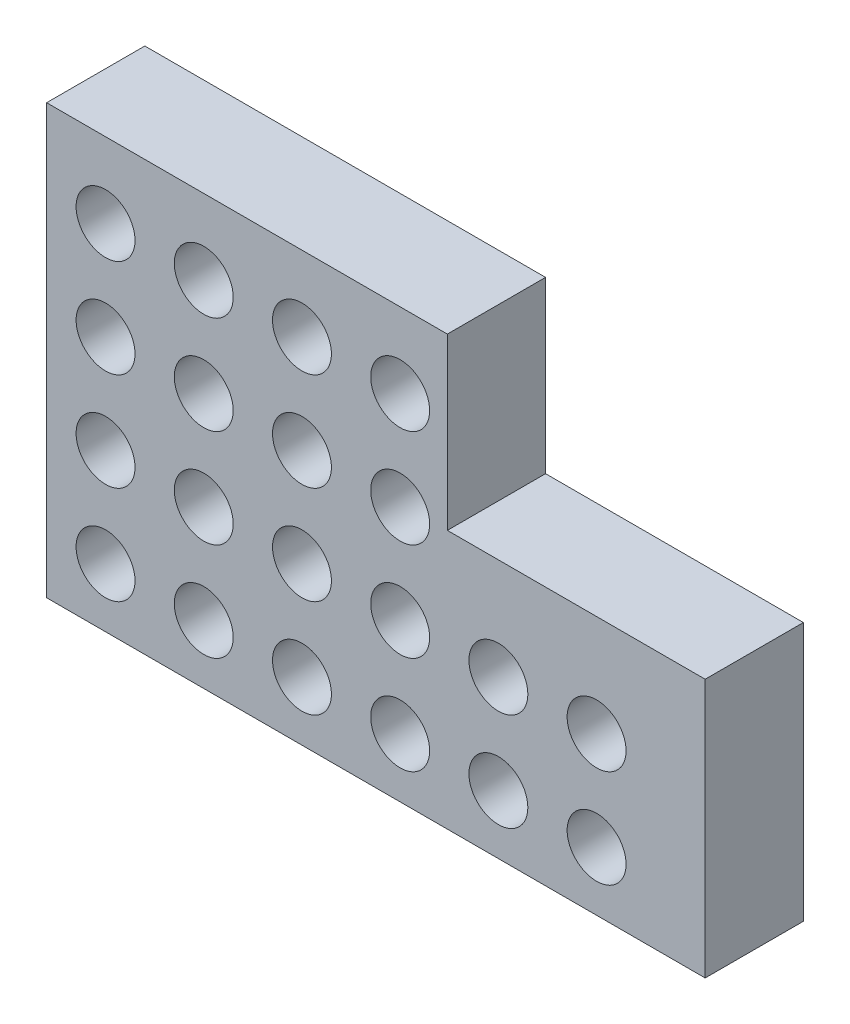
ISO-10303-21;
HEADER;
FILE_DESCRIPTION(('STEP AP214'),'2;1');
FILE_NAME('part.step','',(''),(''),'','','');
FILE_SCHEMA(('AUTOMOTIVE_DESIGN { 1 0 10303 214 1 1 1 1 }'));
ENDSEC;
DATA;
#1=APPLICATION_CONTEXT('core data for automotive mechanical design processes');
#2=APPLICATION_PROTOCOL_DEFINITION('international standard','automotive_design',2000,#1);
#3=PRODUCT_CONTEXT('',#1,'mechanical');
#4=PRODUCT('Part','Part','',(#3));
#5=PRODUCT_RELATED_PRODUCT_CATEGORY('part','',(#4));
#6=PRODUCT_DEFINITION_FORMATION('','',#4);
#7=PRODUCT_DEFINITION_CONTEXT('part definition',#1,'design');
#8=PRODUCT_DEFINITION('design','',#6,#7);
#9=PRODUCT_DEFINITION_SHAPE('','',#8);
#10=(LENGTH_UNIT() NAMED_UNIT(*) SI_UNIT(.MILLI.,.METRE.));
#11=(NAMED_UNIT(*) PLANE_ANGLE_UNIT() SI_UNIT($,.RADIAN.));
#12=(NAMED_UNIT(*) SI_UNIT($,.STERADIAN.) SOLID_ANGLE_UNIT());
#13=UNCERTAINTY_MEASURE_WITH_UNIT(LENGTH_MEASURE(1.E-05),#10,'distance_accuracy_value','');
#14=(GEOMETRIC_REPRESENTATION_CONTEXT(3) GLOBAL_UNCERTAINTY_ASSIGNED_CONTEXT((#13)) GLOBAL_UNIT_ASSIGNED_CONTEXT((#10,
#11,#12)) REPRESENTATION_CONTEXT('',''));
#15=CARTESIAN_POINT('',(0.,0.,0.));
#16=DIRECTION('',(0.,0.,1.));
#17=DIRECTION('',(1.,0.,0.));
#18=AXIS2_PLACEMENT_3D('',#15,#16,#17);
#19=CARTESIAN_POINT('',(67.0563920353644,0.,10.));
#20=DIRECTION('',(0.,1.,0.));
#21=DIRECTION('',(0.,0.,1.));
#22=AXIS2_PLACEMENT_3D('',#19,#20,#21);
#23=PLANE('',#22);
#24=DIRECTION('',(1.,0.,0.));
#25=VECTOR('',#24,1.);
#26=CARTESIAN_POINT('',(67.0563920353644,0.,0.));
#27=LINE('',#26,#25);
#28=CARTESIAN_POINT('',(0.,0.,0.));
#29=VERTEX_POINT('',#28);
#30=CARTESIAN_POINT('',(67.0563920353644,0.,0.));
#31=VERTEX_POINT('',#30);
#32=EDGE_CURVE('E117',#29,#31,#27,.T.);
#33=ORIENTED_EDGE('',*,*,#32,.T.);
#34=DIRECTION('',(0.,0.,-1.));
#35=VECTOR('',#34,1.);
#36=CARTESIAN_POINT('',(67.0563920353644,0.,10.));
#37=LINE('',#36,#35);
#38=CARTESIAN_POINT('',(67.0563920353644,0.,10.));
#39=VERTEX_POINT('',#38);
#40=EDGE_CURVE('E11',#39,#31,#37,.T.);
#41=ORIENTED_EDGE('',*,*,#40,.F.);
#42=DIRECTION('',(1.,0.,0.));
#43=VECTOR('',#42,1.);
#44=CARTESIAN_POINT('',(67.0563920353644,0.,10.));
#45=LINE('',#44,#43);
#46=CARTESIAN_POINT('',(0.,0.,10.));
#47=VERTEX_POINT('',#46);
#48=EDGE_CURVE('E128',#47,#39,#45,.T.);
#49=ORIENTED_EDGE('',*,*,#48,.F.);
#50=DIRECTION('',(0.,0.,-1.));
#51=VECTOR('',#50,1.);
#52=CARTESIAN_POINT('',(0.,0.,10.));
#53=LINE('',#52,#51);
#54=EDGE_CURVE('E113',#47,#29,#53,.T.);
#55=ORIENTED_EDGE('',*,*,#54,.T.);
#56=EDGE_LOOP('',(#33,#41,#49,#55));
#57=FACE_BOUND('',#56,.T.);
#58=ADVANCED_FACE('F33',(#57),#23,.F.);
#59=CARTESIAN_POINT('',(67.0563920353644,26.346979565668,10.));
#60=DIRECTION('',(-1.,0.,0.));
#61=DIRECTION('',(0.,0.,1.));
#62=AXIS2_PLACEMENT_3D('',#59,#60,#61);
#63=PLANE('',#62);
#64=DIRECTION('',(0.,1.,0.));
#65=VECTOR('',#64,1.);
#66=CARTESIAN_POINT('',(67.0563920353644,26.346979565668,0.));
#67=LINE('',#66,#65);
#68=CARTESIAN_POINT('',(67.0563920353644,26.346979565668,0.));
#69=VERTEX_POINT('',#68);
#70=EDGE_CURVE('E120',#31,#69,#67,.T.);
#71=ORIENTED_EDGE('',*,*,#70,.T.);
#72=DIRECTION('',(0.,0.,-1.));
#73=VECTOR('',#72,1.);
#74=CARTESIAN_POINT('',(67.0563920353644,26.346979565668,10.));
#75=LINE('',#74,#73);
#76=CARTESIAN_POINT('',(67.0563920353644,26.346979565668,10.));
#77=VERTEX_POINT('',#76);
#78=EDGE_CURVE('E41',#77,#69,#75,.T.);
#79=ORIENTED_EDGE('',*,*,#78,.F.);
#80=DIRECTION('',(0.,1.,0.));
#81=VECTOR('',#80,1.);
#82=CARTESIAN_POINT('',(67.0563920353644,4.28019523629986,10.));
#83=LINE('',#82,#81);
#84=EDGE_CURVE('E86',#39,#77,#83,.T.);
#85=ORIENTED_EDGE('',*,*,#84,.F.);
#86=ORIENTED_EDGE('',*,*,#40,.T.);
#87=EDGE_LOOP('',(#71,#79,#85,#86));
#88=FACE_BOUND('',#87,.T.);
#89=ADVANCED_FACE('F153',(#88),#63,.F.);
#90=CARTESIAN_POINT('',(40.8045279193919,26.346979565668,10.));
#91=DIRECTION('',(0.,-1.,0.));
#92=DIRECTION('',(0.,0.,-1.));
#93=AXIS2_PLACEMENT_3D('',#90,#91,#92);
#94=PLANE('',#93);
#95=DIRECTION('',(-1.,0.,0.));
#96=VECTOR('',#95,1.);
#97=CARTESIAN_POINT('',(40.8045279193919,26.346979565668,0.));
#98=LINE('',#97,#96);
#99=CARTESIAN_POINT('',(40.8045279193919,26.346979565668,0.));
#100=VERTEX_POINT('',#99);
#101=EDGE_CURVE('E123',#69,#100,#98,.T.);
#102=ORIENTED_EDGE('',*,*,#101,.T.);
#103=DIRECTION('',(0.,0.,-1.));
#104=VECTOR('',#103,1.);
#105=CARTESIAN_POINT('',(40.8045279193919,26.346979565668,10.));
#106=LINE('',#105,#104);
#107=CARTESIAN_POINT('',(40.8045279193919,26.346979565668,10.));
#108=VERTEX_POINT('',#107);
#109=EDGE_CURVE('E108',#108,#100,#106,.T.);
#110=ORIENTED_EDGE('',*,*,#109,.F.);
#111=DIRECTION('',(-1.,0.,0.));
#112=VECTOR('',#111,1.);
#113=CARTESIAN_POINT('',(40.8045279193919,26.346979565668,10.));
#114=LINE('',#113,#112);
#115=EDGE_CURVE('E99',#77,#108,#114,.T.);
#116=ORIENTED_EDGE('',*,*,#115,.F.);
#117=ORIENTED_EDGE('',*,*,#78,.T.);
#118=EDGE_LOOP('',(#102,#110,#116,#117));
#119=FACE_BOUND('',#118,.T.);
#120=ADVANCED_FACE('F134',(#119),#94,.F.);
#121=CARTESIAN_POINT('',(40.8045279193919,43.6579914102585,10.));
#122=DIRECTION('',(-1.,0.,0.));
#123=DIRECTION('',(0.,0.,1.));
#124=AXIS2_PLACEMENT_3D('',#121,#122,#123);
#125=PLANE('',#124);
#126=DIRECTION('',(0.,1.,0.));
#127=VECTOR('',#126,1.);
#128=CARTESIAN_POINT('',(40.8045279193919,43.6579914102585,0.));
#129=LINE('',#128,#127);
#130=CARTESIAN_POINT('',(40.8045279193919,43.6579914102585,0.));
#131=VERTEX_POINT('',#130);
#132=EDGE_CURVE('E107',#100,#131,#129,.T.);
#133=ORIENTED_EDGE('',*,*,#132,.T.);
#134=DIRECTION('',(0.,0.,-1.));
#135=VECTOR('',#134,1.);
#136=CARTESIAN_POINT('',(40.8045279193919,43.6579914102585,10.));
#137=LINE('',#136,#135);
#138=CARTESIAN_POINT('',(40.8045279193919,43.6579914102585,10.));
#139=VERTEX_POINT('',#138);
#140=EDGE_CURVE('E104',#139,#131,#137,.T.);
#141=ORIENTED_EDGE('',*,*,#140,.F.);
#142=DIRECTION('',(0.,1.,0.));
#143=VECTOR('',#142,1.);
#144=CARTESIAN_POINT('',(40.8045279193919,43.6579914102585,10.));
#145=LINE('',#144,#143);
#146=EDGE_CURVE('E93',#108,#139,#145,.T.);
#147=ORIENTED_EDGE('',*,*,#146,.F.);
#148=ORIENTED_EDGE('',*,*,#109,.T.);
#149=EDGE_LOOP('',(#133,#141,#147,#148));
#150=FACE_BOUND('',#149,.T.);
#151=ADVANCED_FACE('F105',(#150),#125,.F.);
#152=CARTESIAN_POINT('',(0.,43.6579914102585,10.));
#153=DIRECTION('',(0.,-1.,0.));
#154=DIRECTION('',(0.,0.,-1.));
#155=AXIS2_PLACEMENT_3D('',#152,#153,#154);
#156=PLANE('',#155);
#157=DIRECTION('',(-1.,0.,0.));
#158=VECTOR('',#157,1.);
#159=CARTESIAN_POINT('',(0.,43.6579914102585,0.));
#160=LINE('',#159,#158);
#161=CARTESIAN_POINT('',(0.,43.6579914102585,0.));
#162=VERTEX_POINT('',#161);
#163=EDGE_CURVE('E72',#131,#162,#160,.T.);
#164=ORIENTED_EDGE('',*,*,#163,.T.);
#165=DIRECTION('',(0.,0.,-1.));
#166=VECTOR('',#165,1.);
#167=CARTESIAN_POINT('',(0.,43.6579914102585,10.));
#168=LINE('',#167,#166);
#169=CARTESIAN_POINT('',(0.,43.6579914102585,10.));
#170=VERTEX_POINT('',#169);
#171=EDGE_CURVE('E109',#170,#162,#168,.T.);
#172=ORIENTED_EDGE('',*,*,#171,.F.);
#173=DIRECTION('',(-1.,0.,0.));
#174=VECTOR('',#173,1.);
#175=CARTESIAN_POINT('',(0.,43.6579914102585,10.));
#176=LINE('',#175,#174);
#177=EDGE_CURVE('E97',#139,#170,#176,.T.);
#178=ORIENTED_EDGE('',*,*,#177,.F.);
#179=ORIENTED_EDGE('',*,*,#140,.T.);
#180=EDGE_LOOP('',(#164,#172,#178,#179));
#181=FACE_BOUND('',#180,.T.);
#182=ADVANCED_FACE('F111',(#181),#156,.F.);
#183=CARTESIAN_POINT('',(0.,0.,10.));
#184=DIRECTION('',(1.,0.,0.));
#185=DIRECTION('',(0.,0.,-1.));
#186=AXIS2_PLACEMENT_3D('',#183,#184,#185);
#187=PLANE('',#186);
#188=DIRECTION('',(0.,-1.,0.));
#189=VECTOR('',#188,1.);
#190=CARTESIAN_POINT('',(0.,0.,0.));
#191=LINE('',#190,#189);
#192=EDGE_CURVE('E78',#162,#29,#191,.T.);
#193=ORIENTED_EDGE('',*,*,#192,.T.);
#194=ORIENTED_EDGE('',*,*,#54,.F.);
#195=DIRECTION('',(0.,-1.,0.));
#196=VECTOR('',#195,1.);
#197=CARTESIAN_POINT('',(0.,0.,10.));
#198=LINE('',#197,#196);
#199=EDGE_CURVE('E49',#170,#47,#198,.T.);
#200=ORIENTED_EDGE('',*,*,#199,.F.);
#201=ORIENTED_EDGE('',*,*,#171,.T.);
#202=EDGE_LOOP('',(#193,#194,#200,#201));
#203=FACE_BOUND('',#202,.T.);
#204=ADVANCED_FACE('F141',(#203),#187,.F.);
#205=CARTESIAN_POINT('',(0.,0.,10.));
#206=DIRECTION('',(0.,0.,-1.));
#207=DIRECTION('',(-1.,0.,0.));
#208=AXIS2_PLACEMENT_3D('',#205,#206,#207);
#209=PLANE('',#208);
#210=CARTESIAN_POINT('',(36.,26.,10.));
#211=DIRECTION('',(0.,0.,1.));
#212=DIRECTION('',(1.,0.,0.));
#213=AXIS2_PLACEMENT_3D('',#210,#211,#212);
#214=CIRCLE('',#213,3.);
#215=CARTESIAN_POINT('',(39.,26.,10.));
#216=VERTEX_POINT('',#215);
#217=EDGE_CURVE('E396',#216,#216,#214,.T.);
#218=ORIENTED_EDGE('',*,*,#217,.F.);
#219=EDGE_LOOP('',(#218));
#220=FACE_BOUND('',#219,.T.);
#221=CARTESIAN_POINT('',(36.,16.,10.));
#222=DIRECTION('',(0.,0.,1.));
#223=DIRECTION('',(1.,0.,0.));
#224=AXIS2_PLACEMENT_3D('',#221,#222,#223);
#225=CIRCLE('',#224,3.);
#226=CARTESIAN_POINT('',(39.,16.,10.));
#227=VERTEX_POINT('',#226);
#228=EDGE_CURVE('E400',#227,#227,#225,.T.);
#229=ORIENTED_EDGE('',*,*,#228,.F.);
#230=EDGE_LOOP('',(#229));
#231=FACE_BOUND('',#230,.T.);
#232=CARTESIAN_POINT('',(36.,6.,10.));
#233=DIRECTION('',(0.,0.,1.));
#234=DIRECTION('',(1.,0.,0.));
#235=AXIS2_PLACEMENT_3D('',#232,#233,#234);
#236=CIRCLE('',#235,3.);
#237=CARTESIAN_POINT('',(39.,6.,10.));
#238=VERTEX_POINT('',#237);
#239=EDGE_CURVE('E417',#238,#238,#236,.T.);
#240=ORIENTED_EDGE('',*,*,#239,.F.);
#241=EDGE_LOOP('',(#240));
#242=FACE_BOUND('',#241,.T.);
#243=CARTESIAN_POINT('',(26.,36.,10.));
#244=DIRECTION('',(0.,0.,1.));
#245=DIRECTION('',(1.,0.,0.));
#246=AXIS2_PLACEMENT_3D('',#243,#244,#245);
#247=CIRCLE('',#246,3.);
#248=CARTESIAN_POINT('',(29.,36.,10.));
#249=VERTEX_POINT('',#248);
#250=EDGE_CURVE('E409',#249,#249,#247,.T.);
#251=ORIENTED_EDGE('',*,*,#250,.F.);
#252=EDGE_LOOP('',(#251));
#253=FACE_BOUND('',#252,.T.);
#254=CARTESIAN_POINT('',(56.,16.,10.));
#255=DIRECTION('',(0.,0.,1.));
#256=DIRECTION('',(1.,0.,0.));
#257=AXIS2_PLACEMENT_3D('',#254,#255,#256);
#258=CIRCLE('',#257,3.);
#259=CARTESIAN_POINT('',(59.,16.,10.));
#260=VERTEX_POINT('',#259);
#261=EDGE_CURVE('E590',#260,#260,#258,.T.);
#262=ORIENTED_EDGE('',*,*,#261,.F.);
#263=EDGE_LOOP('',(#262));
#264=FACE_BOUND('',#263,.T.);
#265=CARTESIAN_POINT('',(56.,6.,10.));
#266=DIRECTION('',(0.,0.,1.));
#267=DIRECTION('',(1.,0.,0.));
#268=AXIS2_PLACEMENT_3D('',#265,#266,#267);
#269=CIRCLE('',#268,3.);
#270=CARTESIAN_POINT('',(59.,6.,10.));
#271=VERTEX_POINT('',#270);
#272=EDGE_CURVE('E586',#271,#271,#269,.T.);
#273=ORIENTED_EDGE('',*,*,#272,.F.);
#274=EDGE_LOOP('',(#273));
#275=FACE_BOUND('',#274,.T.);
#276=CARTESIAN_POINT('',(46.,16.,10.));
#277=DIRECTION('',(0.,0.,1.));
#278=DIRECTION('',(1.,0.,0.));
#279=AXIS2_PLACEMENT_3D('',#276,#277,#278);
#280=CIRCLE('',#279,3.);
#281=CARTESIAN_POINT('',(49.,16.,10.));
#282=VERTEX_POINT('',#281);
#283=EDGE_CURVE('E581',#282,#282,#280,.T.);
#284=ORIENTED_EDGE('',*,*,#283,.F.);
#285=EDGE_LOOP('',(#284));
#286=FACE_BOUND('',#285,.T.);
#287=CARTESIAN_POINT('',(46.,6.,10.));
#288=DIRECTION('',(0.,0.,1.));
#289=DIRECTION('',(1.,0.,0.));
#290=AXIS2_PLACEMENT_3D('',#287,#288,#289);
#291=CIRCLE('',#290,3.);
#292=CARTESIAN_POINT('',(49.,6.,10.));
#293=VERTEX_POINT('',#292);
#294=EDGE_CURVE('E573',#293,#293,#291,.T.);
#295=ORIENTED_EDGE('',*,*,#294,.F.);
#296=EDGE_LOOP('',(#295));
#297=FACE_BOUND('',#296,.T.);
#298=CARTESIAN_POINT('',(36.,36.,10.));
#299=DIRECTION('',(0.,0.,1.));
#300=DIRECTION('',(1.,0.,0.));
#301=AXIS2_PLACEMENT_3D('',#298,#299,#300);
#302=CIRCLE('',#301,3.);
#303=CARTESIAN_POINT('',(39.,36.,10.));
#304=VERTEX_POINT('',#303);
#305=EDGE_CURVE('E567',#304,#304,#302,.T.);
#306=ORIENTED_EDGE('',*,*,#305,.F.);
#307=EDGE_LOOP('',(#306));
#308=FACE_BOUND('',#307,.T.);
#309=CARTESIAN_POINT('',(6.,26.,10.));
#310=DIRECTION('',(0.,0.,1.));
#311=DIRECTION('',(1.,0.,0.));
#312=AXIS2_PLACEMENT_3D('',#309,#310,#311);
#313=CIRCLE('',#312,3.);
#314=CARTESIAN_POINT('',(9.,26.,10.));
#315=VERTEX_POINT('',#314);
#316=EDGE_CURVE('E452',#315,#315,#313,.T.);
#317=ORIENTED_EDGE('',*,*,#316,.F.);
#318=EDGE_LOOP('',(#317));
#319=FACE_BOUND('',#318,.T.);
#320=CARTESIAN_POINT('',(6.,36.,10.));
#321=DIRECTION('',(0.,0.,1.));
#322=DIRECTION('',(1.,0.,0.));
#323=AXIS2_PLACEMENT_3D('',#320,#321,#322);
#324=CIRCLE('',#323,3.);
#325=CARTESIAN_POINT('',(9.,36.,10.));
#326=VERTEX_POINT('',#325);
#327=EDGE_CURVE('E460',#326,#326,#324,.T.);
#328=ORIENTED_EDGE('',*,*,#327,.F.);
#329=EDGE_LOOP('',(#328));
#330=FACE_BOUND('',#329,.T.);
#331=CARTESIAN_POINT('',(16.,6.,10.));
#332=DIRECTION('',(0.,0.,1.));
#333=DIRECTION('',(1.,0.,0.));
#334=AXIS2_PLACEMENT_3D('',#331,#332,#333);
#335=CIRCLE('',#334,3.);
#336=CARTESIAN_POINT('',(19.,6.,10.));
#337=VERTEX_POINT('',#336);
#338=EDGE_CURVE('E466',#337,#337,#335,.T.);
#339=ORIENTED_EDGE('',*,*,#338,.F.);
#340=EDGE_LOOP('',(#339));
#341=FACE_BOUND('',#340,.T.);
#342=CARTESIAN_POINT('',(16.,16.,10.));
#343=DIRECTION('',(0.,0.,1.));
#344=DIRECTION('',(1.,0.,0.));
#345=AXIS2_PLACEMENT_3D('',#342,#343,#344);
#346=CIRCLE('',#345,3.);
#347=CARTESIAN_POINT('',(19.,16.,10.));
#348=VERTEX_POINT('',#347);
#349=EDGE_CURVE('E429',#348,#348,#346,.T.);
#350=ORIENTED_EDGE('',*,*,#349,.F.);
#351=EDGE_LOOP('',(#350));
#352=FACE_BOUND('',#351,.T.);
#353=CARTESIAN_POINT('',(16.,26.,10.));
#354=DIRECTION('',(0.,0.,1.));
#355=DIRECTION('',(1.,0.,0.));
#356=AXIS2_PLACEMENT_3D('',#353,#354,#355);
#357=CIRCLE('',#356,3.);
#358=CARTESIAN_POINT('',(19.,26.,10.));
#359=VERTEX_POINT('',#358);
#360=EDGE_CURVE('E422',#359,#359,#357,.T.);
#361=ORIENTED_EDGE('',*,*,#360,.F.);
#362=EDGE_LOOP('',(#361));
#363=FACE_BOUND('',#362,.T.);
#364=CARTESIAN_POINT('',(16.,36.,10.));
#365=DIRECTION('',(0.,0.,1.));
#366=DIRECTION('',(1.,0.,0.));
#367=AXIS2_PLACEMENT_3D('',#364,#365,#366);
#368=CIRCLE('',#367,3.);
#369=CARTESIAN_POINT('',(19.,36.,10.));
#370=VERTEX_POINT('',#369);
#371=EDGE_CURVE('E430',#370,#370,#368,.T.);
#372=ORIENTED_EDGE('',*,*,#371,.F.);
#373=EDGE_LOOP('',(#372));
#374=FACE_BOUND('',#373,.T.);
#375=CARTESIAN_POINT('',(26.,6.,10.));
#376=DIRECTION('',(0.,0.,1.));
#377=DIRECTION('',(1.,0.,0.));
#378=AXIS2_PLACEMENT_3D('',#375,#376,#377);
#379=CIRCLE('',#378,3.);
#380=CARTESIAN_POINT('',(29.,6.,10.));
#381=VERTEX_POINT('',#380);
#382=EDGE_CURVE('E436',#381,#381,#379,.T.);
#383=ORIENTED_EDGE('',*,*,#382,.F.);
#384=EDGE_LOOP('',(#383));
#385=FACE_BOUND('',#384,.T.);
#386=CARTESIAN_POINT('',(26.,16.,10.));
#387=DIRECTION('',(0.,0.,1.));
#388=DIRECTION('',(1.,0.,0.));
#389=AXIS2_PLACEMENT_3D('',#386,#387,#388);
#390=CIRCLE('',#389,3.);
#391=CARTESIAN_POINT('',(29.,16.,10.));
#392=VERTEX_POINT('',#391);
#393=EDGE_CURVE('E442',#392,#392,#390,.T.);
#394=ORIENTED_EDGE('',*,*,#393,.F.);
#395=EDGE_LOOP('',(#394));
#396=FACE_BOUND('',#395,.T.);
#397=CARTESIAN_POINT('',(26.,26.,10.));
#398=DIRECTION('',(0.,0.,1.));
#399=DIRECTION('',(1.,0.,0.));
#400=AXIS2_PLACEMENT_3D('',#397,#398,#399);
#401=CIRCLE('',#400,3.);
#402=CARTESIAN_POINT('',(29.,26.,10.));
#403=VERTEX_POINT('',#402);
#404=EDGE_CURVE('E416',#403,#403,#401,.T.);
#405=ORIENTED_EDGE('',*,*,#404,.F.);
#406=EDGE_LOOP('',(#405));
#407=FACE_BOUND('',#406,.T.);
#408=CARTESIAN_POINT('',(6.,16.,10.));
#409=DIRECTION('',(0.,0.,1.));
#410=DIRECTION('',(1.,0.,0.));
#411=AXIS2_PLACEMENT_3D('',#408,#409,#410);
#412=CIRCLE('',#411,3.);
#413=CARTESIAN_POINT('',(9.,16.,10.));
#414=VERTEX_POINT('',#413);
#415=EDGE_CURVE('E459',#414,#414,#412,.T.);
#416=ORIENTED_EDGE('',*,*,#415,.F.);
#417=EDGE_LOOP('',(#416));
#418=FACE_BOUND('',#417,.T.);
#419=CARTESIAN_POINT('',(6.,6.,10.));
#420=DIRECTION('',(0.,0.,1.));
#421=DIRECTION('',(1.,0.,0.));
#422=AXIS2_PLACEMENT_3D('',#419,#420,#421);
#423=CIRCLE('',#422,3.);
#424=CARTESIAN_POINT('',(9.,6.,10.));
#425=VERTEX_POINT('',#424);
#426=EDGE_CURVE('E481',#425,#425,#423,.T.);
#427=ORIENTED_EDGE('',*,*,#426,.F.);
#428=EDGE_LOOP('',(#427));
#429=FACE_BOUND('',#428,.T.);
#430=ORIENTED_EDGE('',*,*,#48,.T.);
#431=ORIENTED_EDGE('',*,*,#84,.T.);
#432=ORIENTED_EDGE('',*,*,#115,.T.);
#433=ORIENTED_EDGE('',*,*,#146,.T.);
#434=ORIENTED_EDGE('',*,*,#177,.T.);
#435=ORIENTED_EDGE('',*,*,#199,.T.);
#436=EDGE_LOOP('',(#430,#431,#432,#433,#434,#435));
#437=FACE_BOUND('',#436,.T.);
#438=ADVANCED_FACE('F95',(#220,#231,#242,#253,#264,#275,#286,#297,#308,#319,#330,#341,#352,#363,
#374,#385,#396,#407,#418,#429,#437),#209,.F.);
#439=CARTESIAN_POINT('',(0.,0.,0.));
#440=DIRECTION('',(0.,0.,-1.));
#441=DIRECTION('',(-1.,0.,0.));
#442=AXIS2_PLACEMENT_3D('',#439,#440,#441);
#443=PLANE('',#442);
#444=CARTESIAN_POINT('',(36.,26.,0.));
#445=DIRECTION('',(0.,0.,-1.));
#446=DIRECTION('',(-1.,0.,0.));
#447=AXIS2_PLACEMENT_3D('',#444,#445,#446);
#448=CIRCLE('',#447,3.);
#449=CARTESIAN_POINT('',(33.,26.,0.));
#450=VERTEX_POINT('',#449);
#451=EDGE_CURVE('E399',#450,#450,#448,.F.);
#452=ORIENTED_EDGE('',*,*,#451,.T.);
#453=EDGE_LOOP('',(#452));
#454=FACE_BOUND('',#453,.T.);
#455=CARTESIAN_POINT('',(36.,16.,0.));
#456=DIRECTION('',(0.,0.,-1.));
#457=DIRECTION('',(-1.,0.,0.));
#458=AXIS2_PLACEMENT_3D('',#455,#456,#457);
#459=CIRCLE('',#458,3.);
#460=CARTESIAN_POINT('',(33.,16.,0.));
#461=VERTEX_POINT('',#460);
#462=EDGE_CURVE('E403',#461,#461,#459,.F.);
#463=ORIENTED_EDGE('',*,*,#462,.T.);
#464=EDGE_LOOP('',(#463));
#465=FACE_BOUND('',#464,.T.);
#466=CARTESIAN_POINT('',(36.,6.,0.));
#467=DIRECTION('',(0.,0.,-1.));
#468=DIRECTION('',(-1.,0.,0.));
#469=AXIS2_PLACEMENT_3D('',#466,#467,#468);
#470=CIRCLE('',#469,3.);
#471=CARTESIAN_POINT('',(33.,6.,0.));
#472=VERTEX_POINT('',#471);
#473=EDGE_CURVE('E413',#472,#472,#470,.F.);
#474=ORIENTED_EDGE('',*,*,#473,.T.);
#475=EDGE_LOOP('',(#474));
#476=FACE_BOUND('',#475,.T.);
#477=CARTESIAN_POINT('',(26.,36.,0.));
#478=DIRECTION('',(0.,0.,-1.));
#479=DIRECTION('',(-1.,0.,0.));
#480=AXIS2_PLACEMENT_3D('',#477,#478,#479);
#481=CIRCLE('',#480,3.);
#482=CARTESIAN_POINT('',(23.,36.,0.));
#483=VERTEX_POINT('',#482);
#484=EDGE_CURVE('E412',#483,#483,#481,.F.);
#485=ORIENTED_EDGE('',*,*,#484,.T.);
#486=EDGE_LOOP('',(#485));
#487=FACE_BOUND('',#486,.T.);
#488=CARTESIAN_POINT('',(56.,16.,0.));
#489=DIRECTION('',(0.,0.,-1.));
#490=DIRECTION('',(-1.,0.,0.));
#491=AXIS2_PLACEMENT_3D('',#488,#489,#490);
#492=CIRCLE('',#491,3.);
#493=CARTESIAN_POINT('',(53.,16.,0.));
#494=VERTEX_POINT('',#493);
#495=EDGE_CURVE('E551',#494,#494,#492,.F.);
#496=ORIENTED_EDGE('',*,*,#495,.T.);
#497=EDGE_LOOP('',(#496));
#498=FACE_BOUND('',#497,.T.);
#499=CARTESIAN_POINT('',(56.,6.,0.));
#500=DIRECTION('',(0.,0.,-1.));
#501=DIRECTION('',(-1.,0.,0.));
#502=AXIS2_PLACEMENT_3D('',#499,#500,#501);
#503=CIRCLE('',#502,3.);
#504=CARTESIAN_POINT('',(53.,6.,0.));
#505=VERTEX_POINT('',#504);
#506=EDGE_CURVE('E555',#505,#505,#503,.F.);
#507=ORIENTED_EDGE('',*,*,#506,.T.);
#508=EDGE_LOOP('',(#507));
#509=FACE_BOUND('',#508,.T.);
#510=CARTESIAN_POINT('',(46.,16.,0.));
#511=DIRECTION('',(0.,0.,-1.));
#512=DIRECTION('',(-1.,0.,0.));
#513=AXIS2_PLACEMENT_3D('',#510,#511,#512);
#514=CIRCLE('',#513,3.);
#515=CARTESIAN_POINT('',(43.,16.,0.));
#516=VERTEX_POINT('',#515);
#517=EDGE_CURVE('E559',#516,#516,#514,.F.);
#518=ORIENTED_EDGE('',*,*,#517,.T.);
#519=EDGE_LOOP('',(#518));
#520=FACE_BOUND('',#519,.T.);
#521=CARTESIAN_POINT('',(46.,6.,0.));
#522=DIRECTION('',(0.,0.,-1.));
#523=DIRECTION('',(-1.,0.,0.));
#524=AXIS2_PLACEMENT_3D('',#521,#522,#523);
#525=CIRCLE('',#524,3.);
#526=CARTESIAN_POINT('',(43.,6.,0.));
#527=VERTEX_POINT('',#526);
#528=EDGE_CURVE('E563',#527,#527,#525,.F.);
#529=ORIENTED_EDGE('',*,*,#528,.T.);
#530=EDGE_LOOP('',(#529));
#531=FACE_BOUND('',#530,.T.);
#532=CARTESIAN_POINT('',(36.,36.,0.));
#533=DIRECTION('',(0.,0.,-1.));
#534=DIRECTION('',(-1.,0.,0.));
#535=AXIS2_PLACEMENT_3D('',#532,#533,#534);
#536=CIRCLE('',#535,3.);
#537=CARTESIAN_POINT('',(33.,36.,0.));
#538=VERTEX_POINT('',#537);
#539=EDGE_CURVE('E405',#538,#538,#536,.F.);
#540=ORIENTED_EDGE('',*,*,#539,.T.);
#541=EDGE_LOOP('',(#540));
#542=FACE_BOUND('',#541,.T.);
#543=CARTESIAN_POINT('',(6.,26.,0.));
#544=DIRECTION('',(0.,0.,-1.));
#545=DIRECTION('',(-1.,0.,0.));
#546=AXIS2_PLACEMENT_3D('',#543,#544,#545);
#547=CIRCLE('',#546,3.);
#548=CARTESIAN_POINT('',(3.,26.,0.));
#549=VERTEX_POINT('',#548);
#550=EDGE_CURVE('E455',#549,#549,#547,.F.);
#551=ORIENTED_EDGE('',*,*,#550,.T.);
#552=EDGE_LOOP('',(#551));
#553=FACE_BOUND('',#552,.T.);
#554=CARTESIAN_POINT('',(6.,36.,0.));
#555=DIRECTION('',(0.,0.,-1.));
#556=DIRECTION('',(-1.,0.,0.));
#557=AXIS2_PLACEMENT_3D('',#554,#555,#556);
#558=CIRCLE('',#557,3.);
#559=CARTESIAN_POINT('',(3.,36.,0.));
#560=VERTEX_POINT('',#559);
#561=EDGE_CURVE('E456',#560,#560,#558,.F.);
#562=ORIENTED_EDGE('',*,*,#561,.T.);
#563=EDGE_LOOP('',(#562));
#564=FACE_BOUND('',#563,.T.);
#565=CARTESIAN_POINT('',(16.,6.,0.));
#566=DIRECTION('',(0.,0.,-1.));
#567=DIRECTION('',(-1.,0.,0.));
#568=AXIS2_PLACEMENT_3D('',#565,#566,#567);
#569=CIRCLE('',#568,3.);
#570=CARTESIAN_POINT('',(13.,6.,0.));
#571=VERTEX_POINT('',#570);
#572=EDGE_CURVE('E463',#571,#571,#569,.F.);
#573=ORIENTED_EDGE('',*,*,#572,.T.);
#574=EDGE_LOOP('',(#573));
#575=FACE_BOUND('',#574,.T.);
#576=CARTESIAN_POINT('',(16.,16.,0.));
#577=DIRECTION('',(0.,0.,-1.));
#578=DIRECTION('',(-1.,0.,0.));
#579=AXIS2_PLACEMENT_3D('',#576,#577,#578);
#580=CIRCLE('',#579,3.);
#581=CARTESIAN_POINT('',(13.,16.,0.));
#582=VERTEX_POINT('',#581);
#583=EDGE_CURVE('E469',#582,#582,#580,.F.);
#584=ORIENTED_EDGE('',*,*,#583,.T.);
#585=EDGE_LOOP('',(#584));
#586=FACE_BOUND('',#585,.T.);
#587=CARTESIAN_POINT('',(16.,26.,0.));
#588=DIRECTION('',(0.,0.,-1.));
#589=DIRECTION('',(-1.,0.,0.));
#590=AXIS2_PLACEMENT_3D('',#587,#588,#589);
#591=CIRCLE('',#590,3.);
#592=CARTESIAN_POINT('',(13.,26.,0.));
#593=VERTEX_POINT('',#592);
#594=EDGE_CURVE('E425',#593,#593,#591,.F.);
#595=ORIENTED_EDGE('',*,*,#594,.T.);
#596=EDGE_LOOP('',(#595));
#597=FACE_BOUND('',#596,.T.);
#598=CARTESIAN_POINT('',(16.,36.,0.));
#599=DIRECTION('',(0.,0.,-1.));
#600=DIRECTION('',(-1.,0.,0.));
#601=AXIS2_PLACEMENT_3D('',#598,#599,#600);
#602=CIRCLE('',#601,3.);
#603=CARTESIAN_POINT('',(13.,36.,0.));
#604=VERTEX_POINT('',#603);
#605=EDGE_CURVE('E426',#604,#604,#602,.F.);
#606=ORIENTED_EDGE('',*,*,#605,.T.);
#607=EDGE_LOOP('',(#606));
#608=FACE_BOUND('',#607,.T.);
#609=CARTESIAN_POINT('',(26.,6.,0.));
#610=DIRECTION('',(0.,0.,-1.));
#611=DIRECTION('',(-1.,0.,0.));
#612=AXIS2_PLACEMENT_3D('',#609,#610,#611);
#613=CIRCLE('',#612,3.);
#614=CARTESIAN_POINT('',(23.,6.,0.));
#615=VERTEX_POINT('',#614);
#616=EDGE_CURVE('E433',#615,#615,#613,.F.);
#617=ORIENTED_EDGE('',*,*,#616,.T.);
#618=EDGE_LOOP('',(#617));
#619=FACE_BOUND('',#618,.T.);
#620=CARTESIAN_POINT('',(26.,16.,0.));
#621=DIRECTION('',(0.,0.,-1.));
#622=DIRECTION('',(-1.,0.,0.));
#623=AXIS2_PLACEMENT_3D('',#620,#621,#622);
#624=CIRCLE('',#623,3.);
#625=CARTESIAN_POINT('',(23.,16.,0.));
#626=VERTEX_POINT('',#625);
#627=EDGE_CURVE('E439',#626,#626,#624,.F.);
#628=ORIENTED_EDGE('',*,*,#627,.T.);
#629=EDGE_LOOP('',(#628));
#630=FACE_BOUND('',#629,.T.);
#631=CARTESIAN_POINT('',(26.,26.,0.));
#632=DIRECTION('',(0.,0.,-1.));
#633=DIRECTION('',(-1.,0.,0.));
#634=AXIS2_PLACEMENT_3D('',#631,#632,#633);
#635=CIRCLE('',#634,3.);
#636=CARTESIAN_POINT('',(23.,26.,0.));
#637=VERTEX_POINT('',#636);
#638=EDGE_CURVE('E445',#637,#637,#635,.F.);
#639=ORIENTED_EDGE('',*,*,#638,.T.);
#640=EDGE_LOOP('',(#639));
#641=FACE_BOUND('',#640,.T.);
#642=CARTESIAN_POINT('',(6.,16.,0.));
#643=DIRECTION('',(0.,0.,-1.));
#644=DIRECTION('',(-1.,0.,0.));
#645=AXIS2_PLACEMENT_3D('',#642,#643,#644);
#646=CIRCLE('',#645,3.);
#647=CARTESIAN_POINT('',(3.,16.,0.));
#648=VERTEX_POINT('',#647);
#649=EDGE_CURVE('E478',#648,#648,#646,.F.);
#650=ORIENTED_EDGE('',*,*,#649,.T.);
#651=EDGE_LOOP('',(#650));
#652=FACE_BOUND('',#651,.T.);
#653=CARTESIAN_POINT('',(6.,6.,0.));
#654=DIRECTION('',(0.,0.,-1.));
#655=DIRECTION('',(-1.,0.,0.));
#656=AXIS2_PLACEMENT_3D('',#653,#654,#655);
#657=CIRCLE('',#656,3.);
#658=CARTESIAN_POINT('',(3.,6.,0.));
#659=VERTEX_POINT('',#658);
#660=EDGE_CURVE('E121',#659,#659,#657,.F.);
#661=ORIENTED_EDGE('',*,*,#660,.T.);
#662=EDGE_LOOP('',(#661));
#663=FACE_BOUND('',#662,.T.);
#664=ORIENTED_EDGE('',*,*,#32,.F.);
#665=ORIENTED_EDGE('',*,*,#192,.F.);
#666=ORIENTED_EDGE('',*,*,#163,.F.);
#667=ORIENTED_EDGE('',*,*,#132,.F.);
#668=ORIENTED_EDGE('',*,*,#101,.F.);
#669=ORIENTED_EDGE('',*,*,#70,.F.);
#670=EDGE_LOOP('',(#664,#665,#666,#667,#668,#669));
#671=FACE_BOUND('',#670,.T.);
#672=ADVANCED_FACE('F137',(#454,#465,#476,#487,#498,#509,#520,#531,#542,#553,#564,#575,#586,
#597,#608,#619,#630,#641,#652,#663,#671),#443,.T.);
#673=CARTESIAN_POINT('',(6.,6.,-8.48528137423857));
#674=DIRECTION('',(0.,0.,1.));
#675=DIRECTION('',(1.,0.,0.));
#676=AXIS2_PLACEMENT_3D('',#673,#674,#675);
#677=CYLINDRICAL_SURFACE('',#676,3.);
#678=ORIENTED_EDGE('',*,*,#426,.T.);
#679=EDGE_LOOP('',(#678));
#680=FACE_BOUND('',#679,.T.);
#681=ORIENTED_EDGE('',*,*,#660,.F.);
#682=EDGE_LOOP('',(#681));
#683=FACE_BOUND('',#682,.T.);
#684=ADVANCED_FACE('F181',(#680,#683),#677,.F.);
#685=CARTESIAN_POINT('',(6.,16.,-8.48528137423857));
#686=DIRECTION('',(0.,0.,1.));
#687=DIRECTION('',(1.,0.,0.));
#688=AXIS2_PLACEMENT_3D('',#685,#686,#687);
#689=CYLINDRICAL_SURFACE('',#688,3.);
#690=ORIENTED_EDGE('',*,*,#415,.T.);
#691=EDGE_LOOP('',(#690));
#692=FACE_BOUND('',#691,.T.);
#693=ORIENTED_EDGE('',*,*,#649,.F.);
#694=EDGE_LOOP('',(#693));
#695=FACE_BOUND('',#694,.T.);
#696=ADVANCED_FACE('F186',(#692,#695),#689,.F.);
#697=CARTESIAN_POINT('',(26.,26.,-8.48528137423857));
#698=DIRECTION('',(0.,0.,1.));
#699=DIRECTION('',(1.,0.,0.));
#700=AXIS2_PLACEMENT_3D('',#697,#698,#699);
#701=CYLINDRICAL_SURFACE('',#700,3.);
#702=ORIENTED_EDGE('',*,*,#404,.T.);
#703=EDGE_LOOP('',(#702));
#704=FACE_BOUND('',#703,.T.);
#705=ORIENTED_EDGE('',*,*,#638,.F.);
#706=EDGE_LOOP('',(#705));
#707=FACE_BOUND('',#706,.T.);
#708=ADVANCED_FACE('F209',(#704,#707),#701,.F.);
#709=CARTESIAN_POINT('',(26.,16.,-8.48528137423857));
#710=DIRECTION('',(0.,0.,1.));
#711=DIRECTION('',(1.,0.,0.));
#712=AXIS2_PLACEMENT_3D('',#709,#710,#711);
#713=CYLINDRICAL_SURFACE('',#712,3.);
#714=ORIENTED_EDGE('',*,*,#393,.T.);
#715=EDGE_LOOP('',(#714));
#716=FACE_BOUND('',#715,.T.);
#717=ORIENTED_EDGE('',*,*,#627,.F.);
#718=EDGE_LOOP('',(#717));
#719=FACE_BOUND('',#718,.T.);
#720=ADVANCED_FACE('F219',(#716,#719),#713,.F.);
#721=CARTESIAN_POINT('',(26.,6.,-8.48528137423857));
#722=DIRECTION('',(0.,0.,1.));
#723=DIRECTION('',(1.,0.,0.));
#724=AXIS2_PLACEMENT_3D('',#721,#722,#723);
#725=CYLINDRICAL_SURFACE('',#724,3.);
#726=ORIENTED_EDGE('',*,*,#382,.T.);
#727=EDGE_LOOP('',(#726));
#728=FACE_BOUND('',#727,.T.);
#729=ORIENTED_EDGE('',*,*,#616,.F.);
#730=EDGE_LOOP('',(#729));
#731=FACE_BOUND('',#730,.T.);
#732=ADVANCED_FACE('F229',(#728,#731),#725,.F.);
#733=CARTESIAN_POINT('',(16.,36.,-8.48528137423856));
#734=DIRECTION('',(0.,0.,1.));
#735=DIRECTION('',(1.,0.,0.));
#736=AXIS2_PLACEMENT_3D('',#733,#734,#735);
#737=CYLINDRICAL_SURFACE('',#736,3.);
#738=ORIENTED_EDGE('',*,*,#371,.T.);
#739=EDGE_LOOP('',(#738));
#740=FACE_BOUND('',#739,.T.);
#741=ORIENTED_EDGE('',*,*,#605,.F.);
#742=EDGE_LOOP('',(#741));
#743=FACE_BOUND('',#742,.T.);
#744=ADVANCED_FACE('F239',(#740,#743),#737,.F.);
#745=CARTESIAN_POINT('',(16.,26.,-8.48528137423857));
#746=DIRECTION('',(0.,0.,1.));
#747=DIRECTION('',(1.,0.,0.));
#748=AXIS2_PLACEMENT_3D('',#745,#746,#747);
#749=CYLINDRICAL_SURFACE('',#748,3.);
#750=ORIENTED_EDGE('',*,*,#360,.T.);
#751=EDGE_LOOP('',(#750));
#752=FACE_BOUND('',#751,.T.);
#753=ORIENTED_EDGE('',*,*,#594,.F.);
#754=EDGE_LOOP('',(#753));
#755=FACE_BOUND('',#754,.T.);
#756=ADVANCED_FACE('F249',(#752,#755),#749,.F.);
#757=CARTESIAN_POINT('',(16.,16.,-8.48528137423857));
#758=DIRECTION('',(0.,0.,1.));
#759=DIRECTION('',(1.,0.,0.));
#760=AXIS2_PLACEMENT_3D('',#757,#758,#759);
#761=CYLINDRICAL_SURFACE('',#760,3.);
#762=ORIENTED_EDGE('',*,*,#349,.T.);
#763=EDGE_LOOP('',(#762));
#764=FACE_BOUND('',#763,.T.);
#765=ORIENTED_EDGE('',*,*,#583,.F.);
#766=EDGE_LOOP('',(#765));
#767=FACE_BOUND('',#766,.T.);
#768=ADVANCED_FACE('F259',(#764,#767),#761,.F.);
#769=CARTESIAN_POINT('',(16.,6.,-8.48528137423857));
#770=DIRECTION('',(0.,0.,1.));
#771=DIRECTION('',(1.,0.,0.));
#772=AXIS2_PLACEMENT_3D('',#769,#770,#771);
#773=CYLINDRICAL_SURFACE('',#772,3.);
#774=ORIENTED_EDGE('',*,*,#338,.T.);
#775=EDGE_LOOP('',(#774));
#776=FACE_BOUND('',#775,.T.);
#777=ORIENTED_EDGE('',*,*,#572,.F.);
#778=EDGE_LOOP('',(#777));
#779=FACE_BOUND('',#778,.T.);
#780=ADVANCED_FACE('F269',(#776,#779),#773,.F.);
#781=CARTESIAN_POINT('',(6.,36.,-8.48528137423856));
#782=DIRECTION('',(0.,0.,1.));
#783=DIRECTION('',(1.,0.,0.));
#784=AXIS2_PLACEMENT_3D('',#781,#782,#783);
#785=CYLINDRICAL_SURFACE('',#784,3.);
#786=ORIENTED_EDGE('',*,*,#327,.T.);
#787=EDGE_LOOP('',(#786));
#788=FACE_BOUND('',#787,.T.);
#789=ORIENTED_EDGE('',*,*,#561,.F.);
#790=EDGE_LOOP('',(#789));
#791=FACE_BOUND('',#790,.T.);
#792=ADVANCED_FACE('F279',(#788,#791),#785,.F.);
#793=CARTESIAN_POINT('',(6.,26.,-8.48528137423857));
#794=DIRECTION('',(0.,0.,1.));
#795=DIRECTION('',(1.,0.,0.));
#796=AXIS2_PLACEMENT_3D('',#793,#794,#795);
#797=CYLINDRICAL_SURFACE('',#796,3.);
#798=ORIENTED_EDGE('',*,*,#316,.T.);
#799=EDGE_LOOP('',(#798));
#800=FACE_BOUND('',#799,.T.);
#801=ORIENTED_EDGE('',*,*,#550,.F.);
#802=EDGE_LOOP('',(#801));
#803=FACE_BOUND('',#802,.T.);
#804=ADVANCED_FACE('F289',(#800,#803),#797,.F.);
#805=CARTESIAN_POINT('',(36.,36.,-8.48528137423856));
#806=DIRECTION('',(0.,0.,1.));
#807=DIRECTION('',(1.,0.,0.));
#808=AXIS2_PLACEMENT_3D('',#805,#806,#807);
#809=CYLINDRICAL_SURFACE('',#808,3.);
#810=ORIENTED_EDGE('',*,*,#305,.T.);
#811=EDGE_LOOP('',(#810));
#812=FACE_BOUND('',#811,.T.);
#813=ORIENTED_EDGE('',*,*,#539,.F.);
#814=EDGE_LOOP('',(#813));
#815=FACE_BOUND('',#814,.T.);
#816=ADVANCED_FACE('F299',(#812,#815),#809,.F.);
#817=CARTESIAN_POINT('',(46.,6.,-8.48528137423857));
#818=DIRECTION('',(0.,0.,1.));
#819=DIRECTION('',(1.,0.,0.));
#820=AXIS2_PLACEMENT_3D('',#817,#818,#819);
#821=CYLINDRICAL_SURFACE('',#820,3.);
#822=ORIENTED_EDGE('',*,*,#294,.T.);
#823=EDGE_LOOP('',(#822));
#824=FACE_BOUND('',#823,.T.);
#825=ORIENTED_EDGE('',*,*,#528,.F.);
#826=EDGE_LOOP('',(#825));
#827=FACE_BOUND('',#826,.T.);
#828=ADVANCED_FACE('F309',(#824,#827),#821,.F.);
#829=CARTESIAN_POINT('',(46.,16.,-8.48528137423857));
#830=DIRECTION('',(0.,0.,1.));
#831=DIRECTION('',(1.,0.,0.));
#832=AXIS2_PLACEMENT_3D('',#829,#830,#831);
#833=CYLINDRICAL_SURFACE('',#832,3.);
#834=ORIENTED_EDGE('',*,*,#283,.T.);
#835=EDGE_LOOP('',(#834));
#836=FACE_BOUND('',#835,.T.);
#837=ORIENTED_EDGE('',*,*,#517,.F.);
#838=EDGE_LOOP('',(#837));
#839=FACE_BOUND('',#838,.T.);
#840=ADVANCED_FACE('F319',(#836,#839),#833,.F.);
#841=CARTESIAN_POINT('',(56.,6.,-8.48528137423856));
#842=DIRECTION('',(0.,0.,1.));
#843=DIRECTION('',(1.,0.,0.));
#844=AXIS2_PLACEMENT_3D('',#841,#842,#843);
#845=CYLINDRICAL_SURFACE('',#844,3.);
#846=ORIENTED_EDGE('',*,*,#272,.T.);
#847=EDGE_LOOP('',(#846));
#848=FACE_BOUND('',#847,.T.);
#849=ORIENTED_EDGE('',*,*,#506,.F.);
#850=EDGE_LOOP('',(#849));
#851=FACE_BOUND('',#850,.T.);
#852=ADVANCED_FACE('F329',(#848,#851),#845,.F.);
#853=CARTESIAN_POINT('',(56.,16.,-8.48528137423856));
#854=DIRECTION('',(0.,0.,1.));
#855=DIRECTION('',(1.,0.,0.));
#856=AXIS2_PLACEMENT_3D('',#853,#854,#855);
#857=CYLINDRICAL_SURFACE('',#856,3.);
#858=ORIENTED_EDGE('',*,*,#261,.T.);
#859=EDGE_LOOP('',(#858));
#860=FACE_BOUND('',#859,.T.);
#861=ORIENTED_EDGE('',*,*,#495,.F.);
#862=EDGE_LOOP('',(#861));
#863=FACE_BOUND('',#862,.T.);
#864=ADVANCED_FACE('F339',(#860,#863),#857,.F.);
#865=CARTESIAN_POINT('',(26.,36.,-8.48528137423856));
#866=DIRECTION('',(0.,0.,1.));
#867=DIRECTION('',(1.,0.,0.));
#868=AXIS2_PLACEMENT_3D('',#865,#866,#867);
#869=CYLINDRICAL_SURFACE('',#868,3.);
#870=ORIENTED_EDGE('',*,*,#250,.T.);
#871=EDGE_LOOP('',(#870));
#872=FACE_BOUND('',#871,.T.);
#873=ORIENTED_EDGE('',*,*,#484,.F.);
#874=EDGE_LOOP('',(#873));
#875=FACE_BOUND('',#874,.T.);
#876=ADVANCED_FACE('F349',(#872,#875),#869,.F.);
#877=CARTESIAN_POINT('',(36.,6.,-8.48528137423856));
#878=DIRECTION('',(0.,0.,1.));
#879=DIRECTION('',(1.,0.,0.));
#880=AXIS2_PLACEMENT_3D('',#877,#878,#879);
#881=CYLINDRICAL_SURFACE('',#880,3.);
#882=ORIENTED_EDGE('',*,*,#239,.T.);
#883=EDGE_LOOP('',(#882));
#884=FACE_BOUND('',#883,.T.);
#885=ORIENTED_EDGE('',*,*,#473,.F.);
#886=EDGE_LOOP('',(#885));
#887=FACE_BOUND('',#886,.T.);
#888=ADVANCED_FACE('F359',(#884,#887),#881,.F.);
#889=CARTESIAN_POINT('',(36.,16.,-8.48528137423856));
#890=DIRECTION('',(0.,0.,1.));
#891=DIRECTION('',(1.,0.,0.));
#892=AXIS2_PLACEMENT_3D('',#889,#890,#891);
#893=CYLINDRICAL_SURFACE('',#892,3.);
#894=ORIENTED_EDGE('',*,*,#228,.T.);
#895=EDGE_LOOP('',(#894));
#896=FACE_BOUND('',#895,.T.);
#897=ORIENTED_EDGE('',*,*,#462,.F.);
#898=EDGE_LOOP('',(#897));
#899=FACE_BOUND('',#898,.T.);
#900=ADVANCED_FACE('F369',(#896,#899),#893,.F.);
#901=CARTESIAN_POINT('',(36.,26.,-8.48528137423856));
#902=DIRECTION('',(0.,0.,1.));
#903=DIRECTION('',(1.,0.,0.));
#904=AXIS2_PLACEMENT_3D('',#901,#902,#903);
#905=CYLINDRICAL_SURFACE('',#904,3.);
#906=ORIENTED_EDGE('',*,*,#217,.T.);
#907=EDGE_LOOP('',(#906));
#908=FACE_BOUND('',#907,.T.);
#909=ORIENTED_EDGE('',*,*,#451,.F.);
#910=EDGE_LOOP('',(#909));
#911=FACE_BOUND('',#910,.T.);
#912=ADVANCED_FACE('F379',(#908,#911),#905,.F.);
#913=CLOSED_SHELL('',(#58,#89,#120,#151,#182,#204,#438,#672,#684,#696,#708,#720,#732,#744,#756,
#768,#780,#792,#804,#816,#828,#840,#852,#864,#876,#888,#900,#912));
#914=MANIFOLD_SOLID_BREP('B2',#913);
#915=ADVANCED_BREP_SHAPE_REPRESENTATION('',(#18,#914),#14);
#916=SHAPE_DEFINITION_REPRESENTATION(#9,#915);
ENDSEC;
END-ISO-10303-21;
